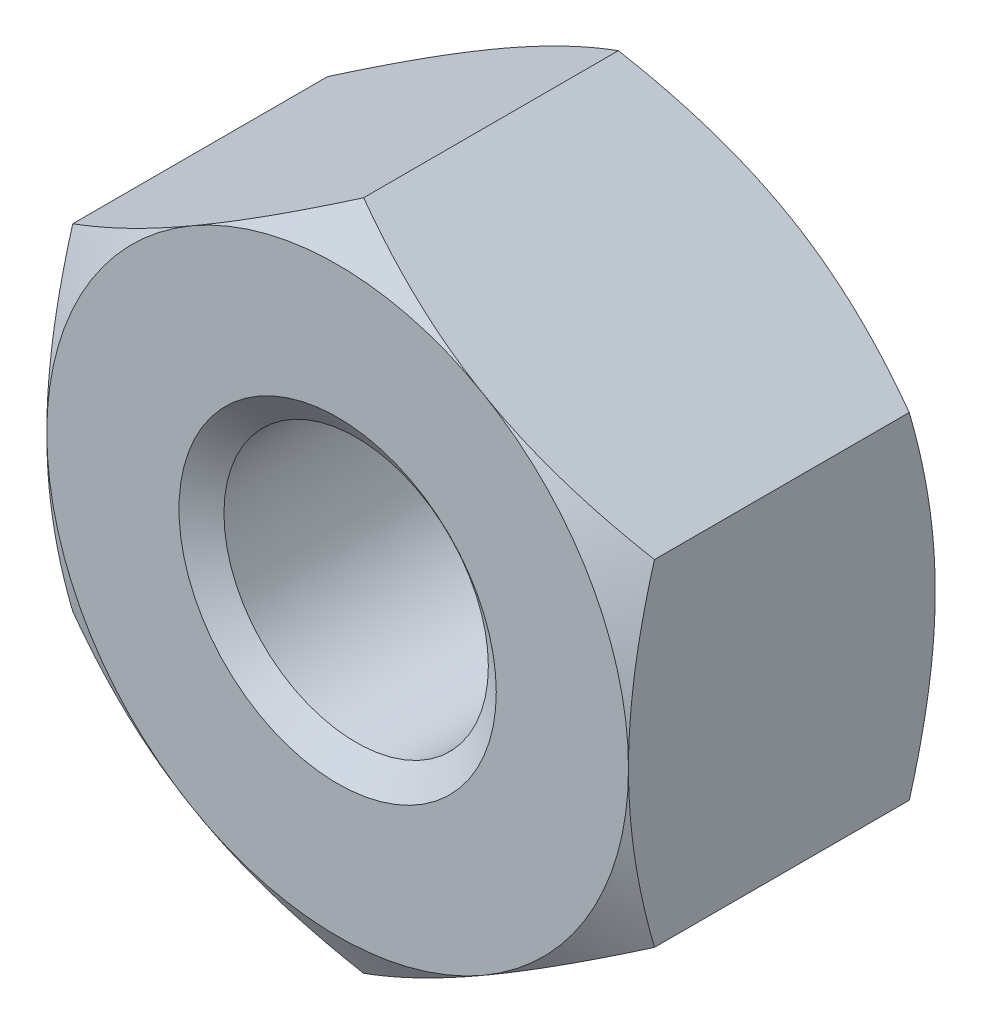
ISO-10303-21;
HEADER;
FILE_DESCRIPTION(('STEP AP214'),'2;1');
FILE_NAME('part.step','',(''),(''),'','','');
FILE_SCHEMA(('AUTOMOTIVE_DESIGN { 1 0 10303 214 1 1 1 1 }'));
ENDSEC;
DATA;
#1=APPLICATION_CONTEXT('core data for automotive mechanical design processes');
#2=APPLICATION_PROTOCOL_DEFINITION('international standard','automotive_design',2000,#1);
#3=PRODUCT_CONTEXT('',#1,'mechanical');
#4=PRODUCT('Part','Part','',(#3));
#5=PRODUCT_RELATED_PRODUCT_CATEGORY('part','',(#4));
#6=PRODUCT_DEFINITION_FORMATION('','',#4);
#7=PRODUCT_DEFINITION_CONTEXT('part definition',#1,'design');
#8=PRODUCT_DEFINITION('design','',#6,#7);
#9=PRODUCT_DEFINITION_SHAPE('','',#8);
#10=(LENGTH_UNIT() NAMED_UNIT(*) SI_UNIT(.MILLI.,.METRE.));
#11=(NAMED_UNIT(*) PLANE_ANGLE_UNIT() SI_UNIT($,.RADIAN.));
#12=(NAMED_UNIT(*) SI_UNIT($,.STERADIAN.) SOLID_ANGLE_UNIT());
#13=UNCERTAINTY_MEASURE_WITH_UNIT(LENGTH_MEASURE(1.E-05),#10,'distance_accuracy_value','');
#14=(GEOMETRIC_REPRESENTATION_CONTEXT(3) GLOBAL_UNCERTAINTY_ASSIGNED_CONTEXT((#13)) GLOBAL_UNIT_ASSIGNED_CONTEXT((#10,
#11,#12)) REPRESENTATION_CONTEXT('',''));
#15=CARTESIAN_POINT('',(0.,0.,0.));
#16=DIRECTION('',(0.,0.,1.));
#17=DIRECTION('',(1.,0.,0.));
#18=AXIS2_PLACEMENT_3D('',#15,#16,#17);
#19=CARTESIAN_POINT('',(0.,0.,-2.9));
#20=DIRECTION('',(0.,0.,1.));
#21=DIRECTION('',(1.,0.,0.));
#22=AXIS2_PLACEMENT_3D('',#19,#20,#21);
#23=CYLINDRICAL_SURFACE('',#22,1.25);
#24=CARTESIAN_POINT('',(0.,0.,-0.175051884552432));
#25=DIRECTION('',(0.,0.,1.));
#26=DIRECTION('',(1.,0.,0.));
#27=AXIS2_PLACEMENT_3D('',#24,#25,#26);
#28=CIRCLE('',#27,1.25);
#29=CARTESIAN_POINT('',(1.25,0.,-0.175051884552432));
#30=VERTEX_POINT('',#29);
#31=EDGE_CURVE('E174',#30,#30,#28,.F.);
#32=ORIENTED_EDGE('',*,*,#31,.F.);
#33=EDGE_LOOP('',(#32));
#34=FACE_BOUND('',#33,.T.);
#35=CARTESIAN_POINT('',(0.,0.,-2.69954811544757));
#36=DIRECTION('',(0.,0.,-1.));
#37=DIRECTION('',(-1.,0.,0.));
#38=AXIS2_PLACEMENT_3D('',#35,#36,#37);
#39=CIRCLE('',#38,1.25);
#40=CARTESIAN_POINT('',(-1.25,0.,-2.69954811544757));
#41=VERTEX_POINT('',#40);
#42=EDGE_CURVE('E39',#41,#41,#39,.F.);
#43=ORIENTED_EDGE('',*,*,#42,.F.);
#44=EDGE_LOOP('',(#43));
#45=FACE_BOUND('',#44,.T.);
#46=ADVANCED_FACE('F34',(#34,#45),#23,.F.);
#47=CARTESIAN_POINT('',(0.,3.17542648054296,-2.9));
#48=DIRECTION('',(0.,0.,-1.));
#49=DIRECTION('',(-1.,0.,0.));
#50=AXIS2_PLACEMENT_3D('',#47,#48,#49);
#51=PLANE('',#50);
#52=CARTESIAN_POINT('',(0.,0.,-2.9));
#53=DIRECTION('',(0.,0.,-1.));
#54=DIRECTION('',(-1.,0.,0.));
#55=AXIS2_PLACEMENT_3D('',#52,#53,#54);
#56=CIRCLE('',#55,2.75);
#57=CARTESIAN_POINT('',(-2.75,0.,-2.9));
#58=VERTEX_POINT('',#57);
#59=CARTESIAN_POINT('',(-1.37500000000002,-2.3815698604072,-2.9));
#60=VERTEX_POINT('',#59);
#61=EDGE_CURVE('E170',#58,#60,#56,.F.);
#62=ORIENTED_EDGE('',*,*,#61,.F.);
#63=CARTESIAN_POINT('',(-1.37500000000002,2.38156986040719,-2.9));
#64=VERTEX_POINT('',#63);
#65=EDGE_CURVE('E152',#64,#58,#56,.F.);
#66=ORIENTED_EDGE('',*,*,#65,.F.);
#67=CARTESIAN_POINT('',(1.37500000000002,2.38156986040719,-2.9));
#68=VERTEX_POINT('',#67);
#69=EDGE_CURVE('E169',#68,#64,#56,.F.);
#70=ORIENTED_EDGE('',*,*,#69,.F.);
#71=CARTESIAN_POINT('',(0.,0.,-2.9));
#72=DIRECTION('',(0.,0.,1.));
#73=DIRECTION('',(1.,0.,0.));
#74=AXIS2_PLACEMENT_3D('',#71,#72,#73);
#75=CIRCLE('',#74,2.75);
#76=CARTESIAN_POINT('',(2.75,0.,-2.9));
#77=VERTEX_POINT('',#76);
#78=EDGE_CURVE('E244',#77,#68,#75,.T.);
#79=ORIENTED_EDGE('',*,*,#78,.F.);
#80=CARTESIAN_POINT('',(1.37500000000002,-2.38156986040719,-2.9));
#81=VERTEX_POINT('',#80);
#82=EDGE_CURVE('E360',#81,#77,#56,.F.);
#83=ORIENTED_EDGE('',*,*,#82,.F.);
#84=EDGE_CURVE('E364',#60,#81,#56,.F.);
#85=ORIENTED_EDGE('',*,*,#84,.F.);
#86=EDGE_LOOP('',(#62,#66,#70,#79,#83,#85));
#87=FACE_BOUND('',#86,.T.);
#88=CARTESIAN_POINT('',(0.,0.,-2.9));
#89=DIRECTION('',(0.,0.,-1.));
#90=DIRECTION('',(-1.,0.,0.));
#91=AXIS2_PLACEMENT_3D('',#88,#89,#90);
#92=CIRCLE('',#91,1.5);
#93=CARTESIAN_POINT('',(-1.5,0.,-2.9));
#94=VERTEX_POINT('',#93);
#95=EDGE_CURVE('E177',#94,#94,#92,.F.);
#96=ORIENTED_EDGE('',*,*,#95,.T.);
#97=EDGE_LOOP('',(#96));
#98=FACE_BOUND('',#97,.T.);
#99=ADVANCED_FACE('F297',(#87,#98),#51,.T.);
#100=CARTESIAN_POINT('',(0.,3.17542648054296,0.));
#101=DIRECTION('',(0.,0.,-1.));
#102=DIRECTION('',(-1.,0.,0.));
#103=AXIS2_PLACEMENT_3D('',#100,#101,#102);
#104=PLANE('',#103);
#105=CARTESIAN_POINT('',(0.,0.,0.));
#106=DIRECTION('',(0.,0.,-1.));
#107=DIRECTION('',(-1.,0.,0.));
#108=AXIS2_PLACEMENT_3D('',#105,#106,#107);
#109=CIRCLE('',#108,2.75);
#110=CARTESIAN_POINT('',(-2.75,0.,0.));
#111=VERTEX_POINT('',#110);
#112=CARTESIAN_POINT('',(-1.37500000000002,2.38156986040719,0.));
#113=VERTEX_POINT('',#112);
#114=EDGE_CURVE('E11',#111,#113,#109,.T.);
#115=ORIENTED_EDGE('',*,*,#114,.F.);
#116=CARTESIAN_POINT('',(-1.37500000000002,-2.3815698604072,0.));
#117=VERTEX_POINT('',#116);
#118=EDGE_CURVE('E46',#117,#111,#109,.T.);
#119=ORIENTED_EDGE('',*,*,#118,.F.);
#120=CARTESIAN_POINT('',(1.37500000000002,-2.38156986040719,0.));
#121=VERTEX_POINT('',#120);
#122=EDGE_CURVE('E173',#121,#117,#109,.T.);
#123=ORIENTED_EDGE('',*,*,#122,.F.);
#124=CARTESIAN_POINT('',(2.75,0.,0.));
#125=VERTEX_POINT('',#124);
#126=EDGE_CURVE('E351',#125,#121,#109,.T.);
#127=ORIENTED_EDGE('',*,*,#126,.F.);
#128=CARTESIAN_POINT('',(0.,0.,0.));
#129=DIRECTION('',(0.,0.,1.));
#130=DIRECTION('',(1.,0.,0.));
#131=AXIS2_PLACEMENT_3D('',#128,#129,#130);
#132=CIRCLE('',#131,2.75);
#133=CARTESIAN_POINT('',(1.37500000000002,2.38156986040719,0.));
#134=VERTEX_POINT('',#133);
#135=EDGE_CURVE('E128',#125,#134,#132,.T.);
#136=ORIENTED_EDGE('',*,*,#135,.T.);
#137=EDGE_CURVE('E44',#113,#134,#109,.T.);
#138=ORIENTED_EDGE('',*,*,#137,.F.);
#139=EDGE_LOOP('',(#115,#119,#123,#127,#136,#138));
#140=FACE_BOUND('',#139,.T.);
#141=CARTESIAN_POINT('',(0.,0.,0.));
#142=DIRECTION('',(0.,0.,1.));
#143=DIRECTION('',(1.,0.,0.));
#144=AXIS2_PLACEMENT_3D('',#141,#142,#143);
#145=CIRCLE('',#144,1.5);
#146=CARTESIAN_POINT('',(1.5,0.,0.));
#147=VERTEX_POINT('',#146);
#148=EDGE_CURVE('E176',#147,#147,#145,.T.);
#149=ORIENTED_EDGE('',*,*,#148,.F.);
#150=EDGE_LOOP('',(#149));
#151=FACE_BOUND('',#150,.T.);
#152=ADVANCED_FACE('F249',(#140,#151),#104,.F.);
#153=CARTESIAN_POINT('',(0.,3.17542648054296,-2.9));
#154=DIRECTION('',(-0.500000000000008,0.866025403784434,0.));
#155=DIRECTION('',(-0.866025403784434,-0.500000000000008,0.));
#156=AXIS2_PLACEMENT_3D('',#153,#154,#155);
#157=PLANE('',#156);
#158=DIRECTION('',(0.,0.,1.));
#159=VECTOR('',#158,1.);
#160=CARTESIAN_POINT('',(-2.75,1.58771324027145,-2.9));
#161=LINE('',#160,#159);
#162=CARTESIAN_POINT('',(-2.75,1.58771324027151,-2.65437990693812));
#163=VERTEX_POINT('',#162);
#164=CARTESIAN_POINT('',(-2.75,1.58771324027145,-0.24562009306186));
#165=VERTEX_POINT('',#164);
#166=EDGE_CURVE('E164',#163,#165,#161,.T.);
#167=ORIENTED_EDGE('',*,*,#166,.T.);
#168=CARTESIAN_POINT('',(-2.7502,1.58759777021761,-0.245686763364759));
#169=CARTESIAN_POINT('',(-2.62935077934009,1.65737010029697,-0.205387662249261));
#170=CARTESIAN_POINT('',(-2.50745839737737,1.72774469983531,-0.16873690259766));
#171=CARTESIAN_POINT('',(-2.26156287327211,1.86971254687001,-0.104762182969798));
#172=CARTESIAN_POINT('',(-2.13755536142615,1.94130831721582,-0.0774608556744948));
#173=CARTESIAN_POINT('',(-1.89107720202406,2.08361254889598,-0.0349617452941144));
#174=CARTESIAN_POINT('',(-1.76864448141259,2.15429911309863,-0.0194811186224555));
#175=CARTESIAN_POINT('',(-1.52320285763109,2.29600490065922,-0.000999397369938858));
#176=CARTESIAN_POINT('',(-1.4001948467671,2.36702360884403,0.00201700053740133));
#177=CARTESIAN_POINT('',(-1.17034121338921,2.49972966594897,-0.00425314542854674));
#178=CARTESIAN_POINT('',(-1.06346120874598,2.56143686540072,-0.0120001542767031));
#179=CARTESIAN_POINT('',(-0.850397532665255,2.68444923614047,-0.0365551810643573));
#180=CARTESIAN_POINT('',(-0.744214598351115,2.74575398185008,-0.0533715896505739));
#181=CARTESIAN_POINT('',(-0.530711510606819,2.86902004703207,-0.0954119223459625));
#182=CARTESIAN_POINT('',(-0.423418383857147,2.93096576264319,-0.120814080687238));
#183=CARTESIAN_POINT('',(-0.210432520715949,3.05393320806135,-0.178467225839992));
#184=CARTESIAN_POINT('',(-0.104737054973347,3.11495651365997,-0.210704663298995));
#185=CARTESIAN_POINT('',(0.000200000000001484,3.1755419505968,-0.245686763364774));
#186=B_SPLINE_CURVE_WITH_KNOTS('',3,(#168,#169,#170,#171,#172,#173,#174,#175,#176,#177,#178,
#179,#180,#181,#182,#183,#184,#185),.UNSPECIFIED.,.F.,.F.,(4,2,2,2,2,2,2,2,4),(0.,
0.435912828725888,0.872873557116333,1.29901931904672,1.72464171213574,2.09526089052938,
2.46622354066375,2.84541551798559,3.22386274754526),.UNSPECIFIED.);
#187=EDGE_CURVE('E133',#165,#113,#186,.T.);
#188=ORIENTED_EDGE('',*,*,#187,.T.);
#189=CARTESIAN_POINT('',(0.,3.17542648054296,-0.245620093061876));
#190=VERTEX_POINT('',#189);
#191=EDGE_CURVE('E53',#113,#190,#186,.T.);
#192=ORIENTED_EDGE('',*,*,#191,.T.);
#193=DIRECTION('',(0.,0.,1.));
#194=VECTOR('',#193,1.);
#195=CARTESIAN_POINT('',(0.,3.17542648054296,-2.9));
#196=LINE('',#195,#194);
#197=CARTESIAN_POINT('',(0.,3.17542648054296,-2.65437990693812));
#198=VERTEX_POINT('',#197);
#199=EDGE_CURVE('E149',#198,#190,#196,.T.);
#200=ORIENTED_EDGE('',*,*,#199,.F.);
#201=CARTESIAN_POINT('',(-2.7502,1.58759777021761,-2.65431323663524));
#202=CARTESIAN_POINT('',(-2.62935077934009,1.65737010029697,-2.69461233775074));
#203=CARTESIAN_POINT('',(-2.50745839737737,1.72774469983531,-2.73126309740234));
#204=CARTESIAN_POINT('',(-2.26156287327211,1.86971254687001,-2.7952378170302));
#205=CARTESIAN_POINT('',(-2.13755536142615,1.94130831721582,-2.8225391443255));
#206=CARTESIAN_POINT('',(-1.89107720202406,2.08361254889598,-2.86503825470589));
#207=CARTESIAN_POINT('',(-1.76864448141259,2.15429911309863,-2.88051888137754));
#208=CARTESIAN_POINT('',(-1.52320285763109,2.29600490065922,-2.89900060263006));
#209=CARTESIAN_POINT('',(-1.4001948467671,2.36702360884403,-2.9020170005374));
#210=CARTESIAN_POINT('',(-1.17034121338921,2.49972966594897,-2.89574685457145));
#211=CARTESIAN_POINT('',(-1.06346120874598,2.56143686540072,-2.8879998457233));
#212=CARTESIAN_POINT('',(-0.850397532665255,2.68444923614047,-2.86344481893564));
#213=CARTESIAN_POINT('',(-0.744214598351115,2.74575398185008,-2.84662841034943));
#214=CARTESIAN_POINT('',(-0.530711510606819,2.86902004703207,-2.80458807765404));
#215=CARTESIAN_POINT('',(-0.423418383857147,2.93096576264319,-2.77918591931276));
#216=CARTESIAN_POINT('',(-0.210432520715949,3.05393320806135,-2.72153277416001));
#217=CARTESIAN_POINT('',(-0.104737054973347,3.11495651365997,-2.68929533670101));
#218=CARTESIAN_POINT('',(0.000200000000001484,3.1755419505968,-2.65431323663523));
#219=B_SPLINE_CURVE_WITH_KNOTS('',3,(#201,#202,#203,#204,#205,#206,#207,#208,#209,#210,#211,
#212,#213,#214,#215,#216,#217,#218),.UNSPECIFIED.,.F.,.F.,(4,2,2,2,2,2,2,2,4),(0.,
0.435912828725888,0.872873557116333,1.29901931904672,1.72464171213574,2.09526089052938,
2.46622354066375,2.84541551798559,3.22386274754526),.UNSPECIFIED.);
#220=EDGE_CURVE('E167',#64,#198,#219,.T.);
#221=ORIENTED_EDGE('',*,*,#220,.F.);
#222=EDGE_CURVE('E259',#163,#64,#219,.T.);
#223=ORIENTED_EDGE('',*,*,#222,.F.);
#224=EDGE_LOOP('',(#167,#188,#192,#200,#221,#223));
#225=FACE_BOUND('',#224,.T.);
#226=ADVANCED_FACE('F36',(#225),#157,.T.);
#227=CARTESIAN_POINT('',(2.75,1.58771324027146,-2.9));
#228=DIRECTION('',(0.500000000000008,0.866025403784434,0.));
#229=DIRECTION('',(-0.866025403784434,0.500000000000008,0.));
#230=AXIS2_PLACEMENT_3D('',#227,#228,#229);
#231=PLANE('',#230);
#232=ORIENTED_EDGE('',*,*,#199,.T.);
#233=CARTESIAN_POINT('',(-0.00019999999999841,3.1755419505968,-0.245686763364774));
#234=CARTESIAN_POINT('',(0.120649220659907,3.10576962051744,-0.205387662249276));
#235=CARTESIAN_POINT('',(0.242541602622635,3.03539502097909,-0.168736902597673));
#236=CARTESIAN_POINT('',(0.488437126727895,2.8934271739444,-0.104762182969809));
#237=CARTESIAN_POINT('',(0.612444638573858,2.82183140359859,-0.0774608556745041));
#238=CARTESIAN_POINT('',(0.858922797975947,2.67952717191843,-0.0349617452941211));
#239=CARTESIAN_POINT('',(0.98135551858742,2.60884060771578,-0.0194811186224611));
#240=CARTESIAN_POINT('',(1.22679714236892,2.46713482015519,-0.000999397369942027));
#241=CARTESIAN_POINT('',(1.34980515323292,2.39611611197038,0.0020170005373994));
#242=CARTESIAN_POINT('',(1.5796587866108,2.26341005486544,-0.00425314542854663));
#243=CARTESIAN_POINT('',(1.68653879125402,2.20170285541368,-0.0120001542767019));
#244=CARTESIAN_POINT('',(1.89960246733475,2.07869048467394,-0.0365551810643538));
#245=CARTESIAN_POINT('',(2.00578540164889,2.01738573896433,-0.0533715896505692));
#246=CARTESIAN_POINT('',(2.21928848939318,1.89411967378234,-0.0954119223459551));
#247=CARTESIAN_POINT('',(2.32658161614286,1.83217395817122,-0.12081408068723));
#248=CARTESIAN_POINT('',(2.53956747928405,1.70920651275306,-0.178467225839981));
#249=CARTESIAN_POINT('',(2.64526294502665,1.64818320715445,-0.210704663298982));
#250=CARTESIAN_POINT('',(2.7502,1.58759777021762,-0.24568676336476));
#251=B_SPLINE_CURVE_WITH_KNOTS('',3,(#233,#234,#235,#236,#237,#238,#239,#240,#241,#242,#243,
#244,#245,#246,#247,#248,#249,#250),.UNSPECIFIED.,.F.,.F.,(4,2,2,2,2,2,2,2,4),(0.,
0.435912828725892,0.872873557116339,1.29901931904673,1.72464171213575,2.09526089052939,
2.46622354066376,2.84541551798559,3.22386274754526),.UNSPECIFIED.);
#252=EDGE_CURVE('E143',#190,#134,#251,.T.);
#253=ORIENTED_EDGE('',*,*,#252,.T.);
#254=CARTESIAN_POINT('',(2.75,1.58771324027151,-0.245620093061876));
#255=VERTEX_POINT('',#254);
#256=EDGE_CURVE('E60',#134,#255,#251,.T.);
#257=ORIENTED_EDGE('',*,*,#256,.T.);
#258=DIRECTION('',(0.,0.,1.));
#259=VECTOR('',#258,1.);
#260=CARTESIAN_POINT('',(2.75,1.58771324027146,-2.9));
#261=LINE('',#260,#259);
#262=CARTESIAN_POINT('',(2.75,1.58771324027151,-2.65437990693812));
#263=VERTEX_POINT('',#262);
#264=EDGE_CURVE('E142',#263,#255,#261,.T.);
#265=ORIENTED_EDGE('',*,*,#264,.F.);
#266=CARTESIAN_POINT('',(-0.00019999999999841,3.1755419505968,-2.65431323663523));
#267=CARTESIAN_POINT('',(0.120649220659908,3.10576962051744,-2.69461233775072));
#268=CARTESIAN_POINT('',(0.242541602622636,3.03539502097909,-2.73126309740233));
#269=CARTESIAN_POINT('',(0.488437126727895,2.8934271739444,-2.79523781703019));
#270=CARTESIAN_POINT('',(0.612444638573858,2.82183140359859,-2.8225391443255));
#271=CARTESIAN_POINT('',(0.858922797975947,2.67952717191843,-2.86503825470588));
#272=CARTESIAN_POINT('',(0.98135551858742,2.60884060771578,-2.88051888137754));
#273=CARTESIAN_POINT('',(1.22679714236892,2.46713482015519,-2.89900060263006));
#274=CARTESIAN_POINT('',(1.34980515323292,2.39611611197038,-2.9020170005374));
#275=CARTESIAN_POINT('',(1.5796587866108,2.26341005486544,-2.89574685457145));
#276=CARTESIAN_POINT('',(1.68653879125402,2.20170285541368,-2.8879998457233));
#277=CARTESIAN_POINT('',(1.89960246733475,2.07869048467394,-2.86344481893565));
#278=CARTESIAN_POINT('',(2.00578540164889,2.01738573896433,-2.84662841034943));
#279=CARTESIAN_POINT('',(2.21928848939318,1.89411967378234,-2.80458807765404));
#280=CARTESIAN_POINT('',(2.32658161614286,1.83217395817122,-2.77918591931277));
#281=CARTESIAN_POINT('',(2.53956747928405,1.70920651275306,-2.72153277416002));
#282=CARTESIAN_POINT('',(2.64526294502665,1.64818320715445,-2.68929533670102));
#283=CARTESIAN_POINT('',(2.7502,1.58759777021762,-2.65431323663524));
#284=B_SPLINE_CURVE_WITH_KNOTS('',3,(#266,#267,#268,#269,#270,#271,#272,#273,#274,#275,#276,
#277,#278,#279,#280,#281,#282,#283),.UNSPECIFIED.,.F.,.F.,(4,2,2,2,2,2,2,2,4),(0.,
0.435912828725892,0.87287355711634,1.29901931904673,1.72464171213575,2.09526089052939,
2.46622354066376,2.84541551798559,3.22386274754526),.UNSPECIFIED.);
#285=EDGE_CURVE('E253',#68,#263,#284,.T.);
#286=ORIENTED_EDGE('',*,*,#285,.F.);
#287=EDGE_CURVE('E258',#198,#68,#284,.T.);
#288=ORIENTED_EDGE('',*,*,#287,.F.);
#289=EDGE_LOOP('',(#232,#253,#257,#265,#286,#288));
#290=FACE_BOUND('',#289,.T.);
#291=ADVANCED_FACE('F140',(#290),#231,.T.);
#292=CARTESIAN_POINT('',(2.75,1.58771324027146,-2.9));
#293=DIRECTION('',(-1.,0.,0.));
#294=DIRECTION('',(0.,0.,1.));
#295=AXIS2_PLACEMENT_3D('',#292,#293,#294);
#296=PLANE('',#295);
#297=CARTESIAN_POINT('',(2.75,-4.21084949309679,-1.31594843960297));
#298=CARTESIAN_POINT('',(2.75,-4.09010894214093,-1.25759993615227));
#299=CARTESIAN_POINT('',(2.75,-3.96908292065512,-1.19983146511761));
#300=CARTESIAN_POINT('',(2.75,-3.72630558284847,-1.08578603842308));
#301=CARTESIAN_POINT('',(2.75,-3.60455414536203,-1.0295093410025));
#302=CARTESIAN_POINT('',(2.75,-3.35951393034357,-0.918482443352782));
#303=CARTESIAN_POINT('',(2.75,-3.23622034236439,-0.863742821605862));
#304=CARTESIAN_POINT('',(2.75,-2.98861980138746,-0.756614777476476));
#305=CARTESIAN_POINT('',(2.75,-2.86431290161185,-0.704226232536785));
#306=CARTESIAN_POINT('',(2.75,-2.61294485887175,-0.601803572146143));
#307=CARTESIAN_POINT('',(2.75,-2.48586863815657,-0.551806257898411));
#308=CARTESIAN_POINT('',(2.75,-2.23021732171543,-0.455727408784617));
#309=CARTESIAN_POINT('',(2.75,-2.10164206103366,-0.409646309576986));
#310=CARTESIAN_POINT('',(2.75,-1.8430521879947,-0.322638077046243));
#311=CARTESIAN_POINT('',(2.75,-1.71304130052586,-0.281699986413899));
#312=CARTESIAN_POINT('',(2.75,-1.4511712506215,-0.206307307624357));
#313=CARTESIAN_POINT('',(2.75,-1.31931268690205,-0.171850669152775));
#314=CARTESIAN_POINT('',(2.75,-1.05365722480015,-0.11109367153091));
#315=CARTESIAN_POINT('',(2.75,-0.919859820217613,-0.0847954840951266));
#316=CARTESIAN_POINT('',(2.75,-0.650651874037402,-0.0421260371966145));
#317=CARTESIAN_POINT('',(2.75,-0.515241331013615,-0.0257547865105455));
#318=CARTESIAN_POINT('',(2.75,-0.24437324286923,-0.00438749654023847));
#319=CARTESIAN_POINT('',(2.75,-0.108921526377152,0.00068055677321543));
#320=CARTESIAN_POINT('',(2.75,0.161887058855117,-0.000827795632671484));
#321=CARTESIAN_POINT('',(2.75,0.297243943089624,-0.00740117868555267));
#322=CARTESIAN_POINT('',(2.75,0.528385436717524,-0.0281041300468421));
#323=CARTESIAN_POINT('',(2.75,0.62442505013748,-0.039537641030186));
#324=CARTESIAN_POINT('',(2.75,0.815762399811519,-0.0675217196133478));
#325=CARTESIAN_POINT('',(2.75,0.911060016631939,-0.0840730942276785));
#326=CARTESIAN_POINT('',(2.75,1.19576218748913,-0.140535361278279));
#327=CARTESIAN_POINT('',(2.75,1.38383224738493,-0.187239859417287));
#328=CARTESIAN_POINT('',(2.75,1.66525048947481,-0.267792497030569));
#329=CARTESIAN_POINT('',(2.75,1.76006556248553,-0.296803334995491));
#330=CARTESIAN_POINT('',(2.75,1.9487060938221,-0.357695648906576));
#331=CARTESIAN_POINT('',(2.75,2.04253218553691,-0.389575144878491));
#332=CARTESIAN_POINT('',(2.75,2.22880240354979,-0.455541418186434));
#333=CARTESIAN_POINT('',(2.75,2.32125133588446,-0.489614761455518));
#334=CARTESIAN_POINT('',(2.75,2.50543192042622,-0.559761368231093));
#335=CARTESIAN_POINT('',(2.75,2.59716326539573,-0.5958354400373));
#336=CARTESIAN_POINT('',(2.75,2.68856293053339,-0.632712441997466));
#337=B_SPLINE_CURVE_WITH_KNOTS('',3,(#297,#298,#299,#300,#301,#302,#303,#304,#305,#306,#307,
#308,#309,#310,#311,#312,#313,#314,#315,#316,#317,#318,#319,#320,#321,#322,#323,#324,#325,#326,
#327,#328,#329,#330,#331,#332,#333,#334,#335,#336),.UNSPECIFIED.,.F.,.F.,(4,2,2,2,2,2,2,2,2,2,2,
2,2,2,2,2,2,2,2,4),(0.,0.402305607365937,0.804680408536999,1.20935783819118,1.61401414820819,
2.02363838185771,2.4333081245735,2.84208969479601,3.25074173456638,3.65950246109145,
4.06826354901185,4.47441284024652,4.88045669141174,5.17046846817547,5.46052599902453,
6.04107275309882,6.3385113130466,6.63574613017453,6.9313079100579,7.22698998004819),.UNSPECIFIED.);
#338=CARTESIAN_POINT('',(2.75000000000001,-1.58771324027149,-0.245620093061876));
#339=VERTEX_POINT('',#338);
#340=EDGE_CURVE('E135',#339,#125,#337,.T.);
#341=ORIENTED_EDGE('',*,*,#340,.F.);
#342=DIRECTION('',(0.,0.,1.));
#343=VECTOR('',#342,1.);
#344=CARTESIAN_POINT('',(2.75,-1.5877132402715,-2.9));
#345=LINE('',#344,#343);
#346=CARTESIAN_POINT('',(2.75000000000001,-1.58771324027149,-2.65437990693812));
#347=VERTEX_POINT('',#346);
#348=EDGE_CURVE('E150',#347,#339,#345,.T.);
#349=ORIENTED_EDGE('',*,*,#348,.F.);
#350=CARTESIAN_POINT('',(2.75,-4.21084949309679,-1.58405156039703));
#351=CARTESIAN_POINT('',(2.75,-4.09010894214093,-1.64240006384773));
#352=CARTESIAN_POINT('',(2.75,-3.96908292065512,-1.70016853488238));
#353=CARTESIAN_POINT('',(2.75,-3.72630558284847,-1.81421396157692));
#354=CARTESIAN_POINT('',(2.75,-3.60455414536203,-1.8704906589975));
#355=CARTESIAN_POINT('',(2.75,-3.35951393034357,-1.98151755664722));
#356=CARTESIAN_POINT('',(2.75,-3.23622034236439,-2.03625717839414));
#357=CARTESIAN_POINT('',(2.75,-2.98861980138746,-2.14338522252352));
#358=CARTESIAN_POINT('',(2.75,-2.86431290161185,-2.19577376746322));
#359=CARTESIAN_POINT('',(2.75,-2.61294485887175,-2.29819642785386));
#360=CARTESIAN_POINT('',(2.75,-2.48586863815657,-2.34819374210159));
#361=CARTESIAN_POINT('',(2.75,-2.23021732171543,-2.44427259121538));
#362=CARTESIAN_POINT('',(2.75,-2.10164206103366,-2.49035369042301));
#363=CARTESIAN_POINT('',(2.75,-1.8430521879947,-2.57736192295376));
#364=CARTESIAN_POINT('',(2.75,-1.71304130052586,-2.6183000135861));
#365=CARTESIAN_POINT('',(2.75,-1.4511712506215,-2.69369269237564));
#366=CARTESIAN_POINT('',(2.75,-1.31931268690205,-2.72814933084722));
#367=CARTESIAN_POINT('',(2.75,-1.05365722480015,-2.78890632846909));
#368=CARTESIAN_POINT('',(2.75,-0.919859820217613,-2.81520451590487));
#369=CARTESIAN_POINT('',(2.75,-0.650651874037402,-2.85787396280339));
#370=CARTESIAN_POINT('',(2.75,-0.515241331013615,-2.87424521348945));
#371=CARTESIAN_POINT('',(2.75,-0.24437324286923,-2.89561250345976));
#372=CARTESIAN_POINT('',(2.75,-0.108921526377152,-2.90068055677322));
#373=CARTESIAN_POINT('',(2.75,0.161887058855117,-2.89917220436733));
#374=CARTESIAN_POINT('',(2.75,0.297243943089624,-2.89259882131445));
#375=CARTESIAN_POINT('',(2.75,0.528385436717524,-2.87189586995316));
#376=CARTESIAN_POINT('',(2.75,0.624425050137481,-2.86046235896981));
#377=CARTESIAN_POINT('',(2.75,0.815762399811519,-2.83247828038665));
#378=CARTESIAN_POINT('',(2.75,0.91106001663194,-2.81592690577232));
#379=CARTESIAN_POINT('',(2.75,1.19576218748913,-2.75946463872172));
#380=CARTESIAN_POINT('',(2.75,1.38383224738493,-2.71276014058271));
#381=CARTESIAN_POINT('',(2.75,1.66525048947481,-2.63220750296943));
#382=CARTESIAN_POINT('',(2.75,1.76006556248553,-2.60319666500451));
#383=CARTESIAN_POINT('',(2.75,1.9487060938221,-2.54230435109342));
#384=CARTESIAN_POINT('',(2.75,2.04253218553691,-2.51042485512151));
#385=CARTESIAN_POINT('',(2.75,2.22880240354979,-2.44445858181357));
#386=CARTESIAN_POINT('',(2.75,2.32125133588446,-2.41038523854448));
#387=CARTESIAN_POINT('',(2.75,2.50543192042623,-2.34023863176891));
#388=CARTESIAN_POINT('',(2.75,2.59716326539573,-2.3041645599627));
#389=CARTESIAN_POINT('',(2.75,2.68856293053339,-2.26728755800253));
#390=B_SPLINE_CURVE_WITH_KNOTS('',3,(#350,#351,#352,#353,#354,#355,#356,#357,#358,#359,#360,
#361,#362,#363,#364,#365,#366,#367,#368,#369,#370,#371,#372,#373,#374,#375,#376,#377,#378,#379,
#380,#381,#382,#383,#384,#385,#386,#387,#388,#389),.UNSPECIFIED.,.F.,.F.,(4,2,2,2,2,2,2,2,2,2,2,
2,2,2,2,2,2,2,2,4),(0.,0.402305607365937,0.804680408536999,1.20935783819118,1.61401414820819,
2.02363838185771,2.4333081245735,2.84208969479601,3.25074173456638,3.65950246109145,
4.06826354901185,4.47441284024652,4.88045669141174,5.17046846817547,5.46052599902453,
6.04107275309882,6.3385113130466,6.63574613017453,6.9313079100579,7.2269899800482),.UNSPECIFIED.);
#391=EDGE_CURVE('E265',#347,#77,#390,.T.);
#392=ORIENTED_EDGE('',*,*,#391,.T.);
#393=EDGE_CURVE('E148',#77,#263,#390,.T.);
#394=ORIENTED_EDGE('',*,*,#393,.T.);
#395=ORIENTED_EDGE('',*,*,#264,.T.);
#396=EDGE_CURVE('E125',#125,#255,#337,.T.);
#397=ORIENTED_EDGE('',*,*,#396,.F.);
#398=EDGE_LOOP('',(#341,#349,#392,#394,#395,#397));
#399=FACE_BOUND('',#398,.T.);
#400=ADVANCED_FACE('F146',(#399),#296,.F.);
#401=CARTESIAN_POINT('',(0.,-3.175426480543,-2.9));
#402=DIRECTION('',(0.500000000000007,-0.866025403784435,0.));
#403=DIRECTION('',(0.866025403784435,0.500000000000007,0.));
#404=AXIS2_PLACEMENT_3D('',#401,#402,#403);
#405=PLANE('',#404);
#406=ORIENTED_EDGE('',*,*,#348,.T.);
#407=CARTESIAN_POINT('',(2.7502,-1.58759777021766,-0.245686763364772));
#408=CARTESIAN_POINT('',(2.62935077934009,-1.65737010029702,-0.205387662249275));
#409=CARTESIAN_POINT('',(2.50745839737736,-1.72774469983536,-0.168736902597674));
#410=CARTESIAN_POINT('',(2.2615628732721,-1.86971254687006,-0.104762182969814));
#411=CARTESIAN_POINT('',(2.13755536142614,-1.94130831721586,-0.0774608556745108));
#412=CARTESIAN_POINT('',(1.89107720202405,-2.08361254889603,-0.034961745294132));
#413=CARTESIAN_POINT('',(1.76864448141258,-2.15429911309868,-0.0194811186224742));
#414=CARTESIAN_POINT('',(1.52320285763108,-2.29600490065927,-0.000999397369959439));
#415=CARTESIAN_POINT('',(1.40019484676708,-2.36702360884408,0.00201700053737997));
#416=CARTESIAN_POINT('',(1.1703412133892,-2.49972966594902,-0.00425314542856976));
#417=CARTESIAN_POINT('',(1.06346120874597,-2.56143686540077,-0.0120001542767267));
#418=CARTESIAN_POINT('',(0.850397532665246,-2.68444923614051,-0.0365551810643817));
#419=CARTESIAN_POINT('',(0.744214598351107,-2.74575398185013,-0.0533715896505985));
#420=CARTESIAN_POINT('',(0.530711510606813,-2.86902004703211,-0.095411922345987));
#421=CARTESIAN_POINT('',(0.423418383857143,-2.93096576264323,-0.120814080687263));
#422=CARTESIAN_POINT('',(0.210432520715948,-3.05393320806139,-0.178467225840016));
#423=CARTESIAN_POINT('',(0.104737054973347,-3.11495651366001,-0.210704663299018));
#424=CARTESIAN_POINT('',(-0.000199999999999593,-3.17554195059683,-0.245686763364796));
#425=B_SPLINE_CURVE_WITH_KNOTS('',3,(#407,#408,#409,#410,#411,#412,#413,#414,#415,#416,#417,
#418,#419,#420,#421,#422,#423,#424),.UNSPECIFIED.,.F.,.F.,(4,2,2,2,2,2,2,2,4),(0.,
0.435912828725892,0.872873557116339,1.29901931904673,1.72464171213575,2.09526089052939,
2.46622354066376,2.84541551798559,3.22386274754526),.UNSPECIFIED.);
#426=EDGE_CURVE('E346',#339,#121,#425,.T.);
#427=ORIENTED_EDGE('',*,*,#426,.T.);
#428=CARTESIAN_POINT('',(0.,-3.17542648054296,-0.245620093061876));
#429=VERTEX_POINT('',#428);
#430=EDGE_CURVE('E225',#121,#429,#425,.T.);
#431=ORIENTED_EDGE('',*,*,#430,.T.);
#432=DIRECTION('',(0.,0.,1.));
#433=VECTOR('',#432,1.);
#434=CARTESIAN_POINT('',(0.,-3.175426480543,-2.9));
#435=LINE('',#434,#433);
#436=CARTESIAN_POINT('',(0.,-3.17542648054296,-2.65437990693812));
#437=VERTEX_POINT('',#436);
#438=EDGE_CURVE('E155',#437,#429,#435,.T.);
#439=ORIENTED_EDGE('',*,*,#438,.F.);
#440=CARTESIAN_POINT('',(2.7502,-1.58759777021766,-2.65431323663523));
#441=CARTESIAN_POINT('',(2.62935077934009,-1.65737010029702,-2.69461233775072));
#442=CARTESIAN_POINT('',(2.50745839737736,-1.72774469983536,-2.73126309740233));
#443=CARTESIAN_POINT('',(2.2615628732721,-1.86971254687006,-2.79523781703019));
#444=CARTESIAN_POINT('',(2.13755536142614,-1.94130831721586,-2.82253914432549));
#445=CARTESIAN_POINT('',(1.89107720202405,-2.08361254889603,-2.86503825470587));
#446=CARTESIAN_POINT('',(1.76864448141258,-2.15429911309868,-2.88051888137753));
#447=CARTESIAN_POINT('',(1.52320285763108,-2.29600490065927,-2.89900060263004));
#448=CARTESIAN_POINT('',(1.40019484676708,-2.36702360884408,-2.90201700053738));
#449=CARTESIAN_POINT('',(1.1703412133892,-2.49972966594902,-2.89574685457143));
#450=CARTESIAN_POINT('',(1.06346120874597,-2.56143686540077,-2.88799984572327));
#451=CARTESIAN_POINT('',(0.850397532665246,-2.68444923614051,-2.86344481893562));
#452=CARTESIAN_POINT('',(0.744214598351107,-2.74575398185013,-2.8466284103494));
#453=CARTESIAN_POINT('',(0.530711510606814,-2.86902004703211,-2.80458807765401));
#454=CARTESIAN_POINT('',(0.423418383857143,-2.93096576264323,-2.77918591931274));
#455=CARTESIAN_POINT('',(0.210432520715948,-3.05393320806139,-2.72153277415998));
#456=CARTESIAN_POINT('',(0.104737054973347,-3.11495651366001,-2.68929533670098));
#457=CARTESIAN_POINT('',(-0.000199999999999591,-3.17554195059683,-2.6543132366352));
#458=B_SPLINE_CURVE_WITH_KNOTS('',3,(#440,#441,#442,#443,#444,#445,#446,#447,#448,#449,#450,
#451,#452,#453,#454,#455,#456,#457),.UNSPECIFIED.,.F.,.F.,(4,2,2,2,2,2,2,2,4),(0.,
0.435912828725892,0.872873557116339,1.29901931904673,1.72464171213575,2.09526089052939,
2.46622354066376,2.84541551798559,3.22386274754526),.UNSPECIFIED.);
#459=EDGE_CURVE('E271',#81,#437,#458,.T.);
#460=ORIENTED_EDGE('',*,*,#459,.F.);
#461=EDGE_CURVE('E270',#347,#81,#458,.T.);
#462=ORIENTED_EDGE('',*,*,#461,.F.);
#463=EDGE_LOOP('',(#406,#427,#431,#439,#460,#462));
#464=FACE_BOUND('',#463,.T.);
#465=ADVANCED_FACE('F281',(#464),#405,.T.);
#466=CARTESIAN_POINT('',(-2.75,-1.5877132402715,-2.9));
#467=DIRECTION('',(-0.500000000000006,-0.866025403784435,0.));
#468=DIRECTION('',(0.866025403784435,-0.500000000000006,0.));
#469=AXIS2_PLACEMENT_3D('',#466,#467,#468);
#470=PLANE('',#469);
#471=ORIENTED_EDGE('',*,*,#438,.T.);
#472=CARTESIAN_POINT('',(0.000200000000001002,-3.17554195059683,-0.245686763364796));
#473=CARTESIAN_POINT('',(-0.120649220659907,-3.10576962051748,-0.205387662249297));
#474=CARTESIAN_POINT('',(-0.242541602622636,-3.03539502097913,-0.168736902597694));
#475=CARTESIAN_POINT('',(-0.488437126727899,-2.89342717394443,-0.10476218296983));
#476=CARTESIAN_POINT('',(-0.612444638573864,-2.82183140359863,-0.0774608556745249));
#477=CARTESIAN_POINT('',(-0.858922797975956,-2.67952717191846,-0.0349617452941417));
#478=CARTESIAN_POINT('',(-0.981355518587431,-2.60884060771581,-0.0194811186224815));
#479=CARTESIAN_POINT('',(-1.22679714236893,-2.46713482015522,-0.000999397369962405));
#480=CARTESIAN_POINT('',(-1.34980515323293,-2.39611611197041,0.00201700053737898));
#481=CARTESIAN_POINT('',(-1.57965878661081,-2.26341005486547,-0.0042531454285673));
#482=CARTESIAN_POINT('',(-1.68653879125404,-2.20170285541372,-0.0120001542767225));
#483=CARTESIAN_POINT('',(-1.89960246733476,-2.07869048467398,-0.0365551810643738));
#484=CARTESIAN_POINT('',(-2.0057854016489,-2.01738573896436,-0.0533715896505887));
#485=CARTESIAN_POINT('',(-2.21928848939319,-1.89411967378238,-0.0954119223459732));
#486=CARTESIAN_POINT('',(-2.32658161614286,-1.83217395817126,-0.120814080687247));
#487=CARTESIAN_POINT('',(-2.53956747928405,-1.70920651275311,-0.178467225839996));
#488=CARTESIAN_POINT('',(-2.64526294502665,-1.64818320715449,-0.210704663298996));
#489=CARTESIAN_POINT('',(-2.7502,-1.58759777021766,-0.245686763364773));
#490=B_SPLINE_CURVE_WITH_KNOTS('',3,(#472,#473,#474,#475,#476,#477,#478,#479,#480,#481,#482,
#483,#484,#485,#486,#487,#488,#489),.UNSPECIFIED.,.F.,.F.,(4,2,2,2,2,2,2,2,4),(0.,
0.435912828725897,0.87287355711635,1.29901931904674,1.72464171213577,2.0952608905294,
2.46622354066377,2.84541551798559,3.22386274754526),.UNSPECIFIED.);
#491=EDGE_CURVE('E344',#429,#117,#490,.T.);
#492=ORIENTED_EDGE('',*,*,#491,.T.);
#493=CARTESIAN_POINT('',(-2.75,-1.58771324027151,-0.245620093061876));
#494=VERTEX_POINT('',#493);
#495=EDGE_CURVE('E199',#117,#494,#490,.T.);
#496=ORIENTED_EDGE('',*,*,#495,.T.);
#497=DIRECTION('',(0.,0.,1.));
#498=VECTOR('',#497,1.);
#499=CARTESIAN_POINT('',(-2.75,-1.5877132402715,-2.9));
#500=LINE('',#499,#498);
#501=CARTESIAN_POINT('',(-2.75,-1.58771324027151,-2.65437990693812));
#502=VERTEX_POINT('',#501);
#503=EDGE_CURVE('E161',#502,#494,#500,.T.);
#504=ORIENTED_EDGE('',*,*,#503,.F.);
#505=CARTESIAN_POINT('',(0.000200000000001002,-3.17554195059683,-2.6543132366352));
#506=CARTESIAN_POINT('',(-0.120649220659907,-3.10576962051748,-2.6946123377507));
#507=CARTESIAN_POINT('',(-0.242541602622636,-3.03539502097913,-2.73126309740231));
#508=CARTESIAN_POINT('',(-0.488437126727899,-2.89342717394443,-2.79523781703017));
#509=CARTESIAN_POINT('',(-0.612444638573864,-2.82183140359863,-2.82253914432548));
#510=CARTESIAN_POINT('',(-0.858922797975956,-2.67952717191846,-2.86503825470586));
#511=CARTESIAN_POINT('',(-0.981355518587431,-2.60884060771581,-2.88051888137752));
#512=CARTESIAN_POINT('',(-1.22679714236893,-2.46713482015522,-2.89900060263004));
#513=CARTESIAN_POINT('',(-1.34980515323293,-2.39611611197041,-2.90201700053738));
#514=CARTESIAN_POINT('',(-1.57965878661081,-2.26341005486547,-2.89574685457143));
#515=CARTESIAN_POINT('',(-1.68653879125404,-2.20170285541372,-2.88799984572328));
#516=CARTESIAN_POINT('',(-1.89960246733476,-2.07869048467398,-2.86344481893563));
#517=CARTESIAN_POINT('',(-2.0057854016489,-2.01738573896436,-2.84662841034941));
#518=CARTESIAN_POINT('',(-2.21928848939319,-1.89411967378238,-2.80458807765403));
#519=CARTESIAN_POINT('',(-2.32658161614286,-1.83217395817126,-2.77918591931275));
#520=CARTESIAN_POINT('',(-2.53956747928405,-1.70920651275311,-2.72153277416));
#521=CARTESIAN_POINT('',(-2.64526294502665,-1.64818320715449,-2.689295336701));
#522=CARTESIAN_POINT('',(-2.7502,-1.58759777021766,-2.65431323663523));
#523=B_SPLINE_CURVE_WITH_KNOTS('',3,(#505,#506,#507,#508,#509,#510,#511,#512,#513,#514,#515,
#516,#517,#518,#519,#520,#521,#522),.UNSPECIFIED.,.F.,.F.,(4,2,2,2,2,2,2,2,4),(0.,
0.435912828725897,0.87287355711635,1.29901931904674,1.72464171213577,2.0952608905294,
2.46622354066377,2.84541551798559,3.22386274754526),.UNSPECIFIED.);
#524=EDGE_CURVE('E277',#60,#502,#523,.T.);
#525=ORIENTED_EDGE('',*,*,#524,.F.);
#526=EDGE_CURVE('E276',#437,#60,#523,.T.);
#527=ORIENTED_EDGE('',*,*,#526,.F.);
#528=EDGE_LOOP('',(#471,#492,#496,#504,#525,#527));
#529=FACE_BOUND('',#528,.T.);
#530=ADVANCED_FACE('F284',(#529),#470,.T.);
#531=CARTESIAN_POINT('',(-2.75,1.58771324027145,-2.9));
#532=DIRECTION('',(-1.,0.,0.));
#533=DIRECTION('',(0.,0.,1.));
#534=AXIS2_PLACEMENT_3D('',#531,#532,#533);
#535=PLANE('',#534);
#536=ORIENTED_EDGE('',*,*,#503,.T.);
#537=CARTESIAN_POINT('',(-2.75,-4.21084949309679,-1.31594843960297));
#538=CARTESIAN_POINT('',(-2.75,-4.09010894214093,-1.25759993615228));
#539=CARTESIAN_POINT('',(-2.75,-3.96908292065512,-1.19983146511762));
#540=CARTESIAN_POINT('',(-2.75,-3.72630558284847,-1.08578603842308));
#541=CARTESIAN_POINT('',(-2.75,-3.60455414536203,-1.0295093410025));
#542=CARTESIAN_POINT('',(-2.75,-3.35951393034358,-0.918482443352784));
#543=CARTESIAN_POINT('',(-2.75,-3.2362203423644,-0.863742821605864));
#544=CARTESIAN_POINT('',(-2.75,-2.98861980138747,-0.756614777476478));
#545=CARTESIAN_POINT('',(-2.75,-2.86431290161185,-0.704226232536786));
#546=CARTESIAN_POINT('',(-2.75,-2.61294485887175,-0.601803572146144));
#547=CARTESIAN_POINT('',(-2.75,-2.48586863815657,-0.551806257898413));
#548=CARTESIAN_POINT('',(-2.75,-2.23021732171544,-0.455727408784618));
#549=CARTESIAN_POINT('',(-2.75,-2.10164206103366,-0.409646309576987));
#550=CARTESIAN_POINT('',(-2.75,-1.8430521879947,-0.322638077046244));
#551=CARTESIAN_POINT('',(-2.75,-1.71304130052586,-0.2816999864139));
#552=CARTESIAN_POINT('',(-2.75,-1.4511712506215,-0.206307307624358));
#553=CARTESIAN_POINT('',(-2.75,-1.31931268690205,-0.171850669152776));
#554=CARTESIAN_POINT('',(-2.75,-1.05365722480015,-0.11109367153091));
#555=CARTESIAN_POINT('',(-2.75,-0.919859820217616,-0.0847954840951271));
#556=CARTESIAN_POINT('',(-2.75,-0.650651874037405,-0.0421260371966149));
#557=CARTESIAN_POINT('',(-2.75,-0.515241331013618,-0.0257547865105459));
#558=CARTESIAN_POINT('',(-2.75,-0.244373242869232,-0.00438749654023852));
#559=CARTESIAN_POINT('',(-2.75,-0.108921526377154,0.000680556773215693));
#560=CARTESIAN_POINT('',(-2.75,0.161887058855115,-0.000827795632671242));
#561=CARTESIAN_POINT('',(-2.75,0.297243943089622,-0.00740117868555271));
#562=CARTESIAN_POINT('',(-2.75,0.528385436717522,-0.0281041300468421));
#563=CARTESIAN_POINT('',(-2.75,0.624425050137478,-0.0395376410301859));
#564=CARTESIAN_POINT('',(-2.75,0.815762399811517,-0.0675217196133474));
#565=CARTESIAN_POINT('',(-2.75,0.911060016631937,-0.084073094227678));
#566=CARTESIAN_POINT('',(-2.75,1.19576218748913,-0.140535361278278));
#567=CARTESIAN_POINT('',(-2.75,1.38383224738493,-0.187239859417286));
#568=CARTESIAN_POINT('',(-2.75,1.66525048947481,-0.267792497030568));
#569=CARTESIAN_POINT('',(-2.75,1.76006556248553,-0.29680333499549));
#570=CARTESIAN_POINT('',(-2.75,1.9487060938221,-0.357695648906575));
#571=CARTESIAN_POINT('',(-2.75,2.04253218553691,-0.38957514487849));
#572=CARTESIAN_POINT('',(-2.75,2.22880240354979,-0.455541418186433));
#573=CARTESIAN_POINT('',(-2.75,2.32125133588445,-0.489614761455517));
#574=CARTESIAN_POINT('',(-2.75,2.50543192042622,-0.559761368231091));
#575=CARTESIAN_POINT('',(-2.75,2.59716326539572,-0.595835440037299));
#576=CARTESIAN_POINT('',(-2.75,2.68856293053339,-0.632712441997465));
#577=B_SPLINE_CURVE_WITH_KNOTS('',3,(#537,#538,#539,#540,#541,#542,#543,#544,#545,#546,#547,
#548,#549,#550,#551,#552,#553,#554,#555,#556,#557,#558,#559,#560,#561,#562,#563,#564,#565,#566,
#567,#568,#569,#570,#571,#572,#573,#574,#575,#576),.UNSPECIFIED.,.F.,.F.,(4,2,2,2,2,2,2,2,2,2,2,
2,2,2,2,2,2,2,2,4),(0.,0.402305607365938,0.804680408537,1.20935783819118,1.61401414820819,
2.02363838185771,2.4333081245735,2.84208969479602,3.25074173456638,3.65950246109145,
4.06826354901186,4.47441284024652,4.88045669141174,5.17046846817548,5.46052599902453,
6.04107275309883,6.33851131304661,6.63574613017453,6.9313079100579,7.2269899800482),.UNSPECIFIED.);
#578=EDGE_CURVE('E198',#494,#111,#577,.T.);
#579=ORIENTED_EDGE('',*,*,#578,.T.);
#580=EDGE_CURVE('E191',#111,#165,#577,.T.);
#581=ORIENTED_EDGE('',*,*,#580,.T.);
#582=ORIENTED_EDGE('',*,*,#166,.F.);
#583=CARTESIAN_POINT('',(-2.75,-4.21084949309679,-1.58405156039703));
#584=CARTESIAN_POINT('',(-2.75,-4.09010894214093,-1.64240006384772));
#585=CARTESIAN_POINT('',(-2.75,-3.96908292065512,-1.70016853488238));
#586=CARTESIAN_POINT('',(-2.75,-3.72630558284847,-1.81421396157692));
#587=CARTESIAN_POINT('',(-2.75,-3.60455414536203,-1.8704906589975));
#588=CARTESIAN_POINT('',(-2.75,-3.35951393034358,-1.98151755664722));
#589=CARTESIAN_POINT('',(-2.75,-3.2362203423644,-2.03625717839414));
#590=CARTESIAN_POINT('',(-2.75,-2.98861980138746,-2.14338522252352));
#591=CARTESIAN_POINT('',(-2.75,-2.86431290161185,-2.19577376746321));
#592=CARTESIAN_POINT('',(-2.75,-2.61294485887175,-2.29819642785386));
#593=CARTESIAN_POINT('',(-2.75,-2.48586863815657,-2.34819374210159));
#594=CARTESIAN_POINT('',(-2.75,-2.23021732171544,-2.44427259121538));
#595=CARTESIAN_POINT('',(-2.75,-2.10164206103366,-2.49035369042301));
#596=CARTESIAN_POINT('',(-2.75,-1.8430521879947,-2.57736192295376));
#597=CARTESIAN_POINT('',(-2.75,-1.71304130052586,-2.6183000135861));
#598=CARTESIAN_POINT('',(-2.75,-1.4511712506215,-2.69369269237564));
#599=CARTESIAN_POINT('',(-2.75,-1.31931268690205,-2.72814933084722));
#600=CARTESIAN_POINT('',(-2.75,-1.05365722480015,-2.78890632846909));
#601=CARTESIAN_POINT('',(-2.75,-0.919859820217616,-2.81520451590487));
#602=CARTESIAN_POINT('',(-2.75,-0.650651874037405,-2.85787396280338));
#603=CARTESIAN_POINT('',(-2.75,-0.515241331013618,-2.87424521348945));
#604=CARTESIAN_POINT('',(-2.75,-0.244373242869233,-2.89561250345976));
#605=CARTESIAN_POINT('',(-2.75,-0.108921526377155,-2.90068055677322));
#606=CARTESIAN_POINT('',(-2.75,0.161887058855114,-2.89917220436733));
#607=CARTESIAN_POINT('',(-2.75,0.297243943089621,-2.89259882131445));
#608=CARTESIAN_POINT('',(-2.75,0.528385436717522,-2.87189586995316));
#609=CARTESIAN_POINT('',(-2.75,0.624425050137478,-2.86046235896981));
#610=CARTESIAN_POINT('',(-2.75,0.815762399811516,-2.83247828038665));
#611=CARTESIAN_POINT('',(-2.75,0.911060016631937,-2.81592690577232));
#612=CARTESIAN_POINT('',(-2.75,1.19576218748913,-2.75946463872172));
#613=CARTESIAN_POINT('',(-2.75,1.38383224738493,-2.71276014058271));
#614=CARTESIAN_POINT('',(-2.75,1.66525048947481,-2.63220750296943));
#615=CARTESIAN_POINT('',(-2.75,1.76006556248553,-2.60319666500451));
#616=CARTESIAN_POINT('',(-2.75,1.9487060938221,-2.54230435109342));
#617=CARTESIAN_POINT('',(-2.75,2.04253218553691,-2.51042485512151));
#618=CARTESIAN_POINT('',(-2.75,2.22880240354979,-2.44445858181357));
#619=CARTESIAN_POINT('',(-2.75,2.32125133588445,-2.41038523854448));
#620=CARTESIAN_POINT('',(-2.75,2.50543192042622,-2.34023863176891));
#621=CARTESIAN_POINT('',(-2.75,2.59716326539572,-2.3041645599627));
#622=CARTESIAN_POINT('',(-2.75,2.68856293053339,-2.26728755800253));
#623=B_SPLINE_CURVE_WITH_KNOTS('',3,(#583,#584,#585,#586,#587,#588,#589,#590,#591,#592,#593,
#594,#595,#596,#597,#598,#599,#600,#601,#602,#603,#604,#605,#606,#607,#608,#609,#610,#611,#612,
#613,#614,#615,#616,#617,#618,#619,#620,#621,#622),.UNSPECIFIED.,.F.,.F.,(4,2,2,2,2,2,2,2,2,2,2,
2,2,2,2,2,2,2,2,4),(0.,0.402305607365938,0.804680408537,1.20935783819118,1.61401414820819,
2.02363838185771,2.4333081245735,2.84208969479602,3.25074173456638,3.65950246109145,
4.06826354901186,4.47441284024652,4.88045669141174,5.17046846817548,5.46052599902453,
6.04107275309883,6.33851131304661,6.63574613017453,6.9313079100579,7.2269899800482),.UNSPECIFIED.);
#624=EDGE_CURVE('E380',#58,#163,#623,.T.);
#625=ORIENTED_EDGE('',*,*,#624,.F.);
#626=EDGE_CURVE('E384',#502,#58,#623,.T.);
#627=ORIENTED_EDGE('',*,*,#626,.F.);
#628=EDGE_LOOP('',(#536,#579,#581,#582,#625,#627));
#629=FACE_BOUND('',#628,.T.);
#630=ADVANCED_FACE('F205',(#629),#535,.T.);
#631=CARTESIAN_POINT('',(0.,0.,-2.9));
#632=DIRECTION('',(0.,0.,1.));
#633=DIRECTION('',(1.,0.,0.));
#634=AXIS2_PLACEMENT_3D('',#631,#632,#633);
#635=CONICAL_SURFACE('',#634,2.75,1.04719755119659);
#636=ORIENTED_EDGE('',*,*,#222,.T.);
#637=ORIENTED_EDGE('',*,*,#65,.T.);
#638=ORIENTED_EDGE('',*,*,#624,.T.);
#639=EDGE_LOOP('',(#636,#637,#638));
#640=FACE_BOUND('',#639,.T.);
#641=ADVANCED_FACE('F294',(#640),#635,.T.);
#642=ORIENTED_EDGE('',*,*,#220,.T.);
#643=ORIENTED_EDGE('',*,*,#287,.T.);
#644=ORIENTED_EDGE('',*,*,#69,.T.);
#645=EDGE_LOOP('',(#642,#643,#644));
#646=FACE_BOUND('',#645,.T.);
#647=ADVANCED_FACE('F372',(#646),#635,.T.);
#648=ORIENTED_EDGE('',*,*,#285,.T.);
#649=ORIENTED_EDGE('',*,*,#393,.F.);
#650=ORIENTED_EDGE('',*,*,#78,.T.);
#651=EDGE_LOOP('',(#648,#649,#650));
#652=FACE_BOUND('',#651,.T.);
#653=ADVANCED_FACE('F383',(#652),#635,.T.);
#654=ORIENTED_EDGE('',*,*,#461,.T.);
#655=ORIENTED_EDGE('',*,*,#82,.T.);
#656=ORIENTED_EDGE('',*,*,#391,.F.);
#657=EDGE_LOOP('',(#654,#655,#656));
#658=FACE_BOUND('',#657,.T.);
#659=ADVANCED_FACE('F358',(#658),#635,.T.);
#660=ORIENTED_EDGE('',*,*,#459,.T.);
#661=ORIENTED_EDGE('',*,*,#526,.T.);
#662=ORIENTED_EDGE('',*,*,#84,.T.);
#663=EDGE_LOOP('',(#660,#661,#662));
#664=FACE_BOUND('',#663,.T.);
#665=ADVANCED_FACE('F365',(#664),#635,.T.);
#666=ORIENTED_EDGE('',*,*,#524,.T.);
#667=ORIENTED_EDGE('',*,*,#626,.T.);
#668=ORIENTED_EDGE('',*,*,#61,.T.);
#669=EDGE_LOOP('',(#666,#667,#668));
#670=FACE_BOUND('',#669,.T.);
#671=ADVANCED_FACE('F213',(#670),#635,.T.);
#672=CARTESIAN_POINT('',(0.,0.,0.));
#673=DIRECTION('',(0.,0.,-1.));
#674=DIRECTION('',(-1.,0.,0.));
#675=AXIS2_PLACEMENT_3D('',#672,#673,#674);
#676=CONICAL_SURFACE('',#675,2.75,1.04719755119659);
#677=ORIENTED_EDGE('',*,*,#118,.T.);
#678=ORIENTED_EDGE('',*,*,#578,.F.);
#679=ORIENTED_EDGE('',*,*,#495,.F.);
#680=EDGE_LOOP('',(#677,#678,#679));
#681=FACE_BOUND('',#680,.T.);
#682=ADVANCED_FACE('F207',(#681),#676,.T.);
#683=ORIENTED_EDGE('',*,*,#122,.T.);
#684=ORIENTED_EDGE('',*,*,#491,.F.);
#685=ORIENTED_EDGE('',*,*,#430,.F.);
#686=EDGE_LOOP('',(#683,#684,#685));
#687=FACE_BOUND('',#686,.T.);
#688=ADVANCED_FACE('F212',(#687),#676,.T.);
#689=ORIENTED_EDGE('',*,*,#340,.T.);
#690=ORIENTED_EDGE('',*,*,#126,.T.);
#691=ORIENTED_EDGE('',*,*,#426,.F.);
#692=EDGE_LOOP('',(#689,#690,#691));
#693=FACE_BOUND('',#692,.T.);
#694=ADVANCED_FACE('F323',(#693),#676,.T.);
#695=ORIENTED_EDGE('',*,*,#135,.F.);
#696=ORIENTED_EDGE('',*,*,#396,.T.);
#697=ORIENTED_EDGE('',*,*,#256,.F.);
#698=EDGE_LOOP('',(#695,#696,#697));
#699=FACE_BOUND('',#698,.T.);
#700=ADVANCED_FACE('F126',(#699),#676,.T.);
#701=ORIENTED_EDGE('',*,*,#137,.T.);
#702=ORIENTED_EDGE('',*,*,#252,.F.);
#703=ORIENTED_EDGE('',*,*,#191,.F.);
#704=EDGE_LOOP('',(#701,#702,#703));
#705=FACE_BOUND('',#704,.T.);
#706=ADVANCED_FACE('F215',(#705),#676,.T.);
#707=ORIENTED_EDGE('',*,*,#580,.F.);
#708=ORIENTED_EDGE('',*,*,#114,.T.);
#709=ORIENTED_EDGE('',*,*,#187,.F.);
#710=EDGE_LOOP('',(#707,#708,#709));
#711=FACE_BOUND('',#710,.T.);
#712=ADVANCED_FACE('F317',(#711),#676,.T.);
#713=CARTESIAN_POINT('',(0.,0.,-0.192557073007676));
#714=DIRECTION('',(0.,0.,1.));
#715=DIRECTION('',(1.,0.,0.));
#716=AXIS2_PLACEMENT_3D('',#713,#714,#715);
#717=CONICAL_SURFACE('',#716,1.225,0.959931088596864);
#718=ORIENTED_EDGE('',*,*,#148,.T.);
#719=EDGE_LOOP('',(#718));
#720=FACE_BOUND('',#719,.T.);
#721=ORIENTED_EDGE('',*,*,#31,.T.);
#722=EDGE_LOOP('',(#721));
#723=FACE_BOUND('',#722,.T.);
#724=ADVANCED_FACE('F216',(#720,#723),#717,.F.);
#725=CARTESIAN_POINT('',(0.,0.,-2.8746));
#726=DIRECTION('',(0.,0.,-1.));
#727=DIRECTION('',(-1.,0.,0.));
#728=AXIS2_PLACEMENT_3D('',#725,#726,#727);
#729=CONICAL_SURFACE('',#728,1.5,0.959931088596886);
#730=CARTESIAN_POINT('',(0.,0.,-2.8746));
#731=DIRECTION('',(0.,0.,1.));
#732=DIRECTION('',(1.,0.,0.));
#733=AXIS2_PLACEMENT_3D('',#730,#731,#732);
#734=CIRCLE('',#733,1.5);
#735=CARTESIAN_POINT('',(1.5,0.,-2.8746));
#736=VERTEX_POINT('',#735);
#737=EDGE_CURVE('E179',#736,#736,#734,.T.);
#738=ORIENTED_EDGE('',*,*,#737,.F.);
#739=EDGE_LOOP('',(#738));
#740=FACE_BOUND('',#739,.T.);
#741=ORIENTED_EDGE('',*,*,#42,.T.);
#742=EDGE_LOOP('',(#741));
#743=FACE_BOUND('',#742,.T.);
#744=ADVANCED_FACE('F307',(#740,#743),#729,.F.);
#745=CARTESIAN_POINT('',(0.,0.,-25.0375057290932));
#746=DIRECTION('',(0.,0.,1.));
#747=DIRECTION('',(1.,0.,0.));
#748=AXIS2_PLACEMENT_3D('',#745,#746,#747);
#749=CYLINDRICAL_SURFACE('',#748,1.5);
#750=ORIENTED_EDGE('',*,*,#95,.F.);
#751=EDGE_LOOP('',(#750));
#752=FACE_BOUND('',#751,.T.);
#753=ORIENTED_EDGE('',*,*,#737,.T.);
#754=EDGE_LOOP('',(#753));
#755=FACE_BOUND('',#754,.T.);
#756=ADVANCED_FACE('F309',(#752,#755),#749,.F.);
#757=CLOSED_SHELL('',(#46,#99,#152,#226,#291,#400,#465,#530,#630,#641,#647,#653,#659,#665,#671,
#682,#688,#694,#700,#706,#712,#724,#744,#756));
#758=MANIFOLD_SOLID_BREP('B2',#757);
#759=ADVANCED_BREP_SHAPE_REPRESENTATION('',(#18,#758),#14);
#760=SHAPE_DEFINITION_REPRESENTATION(#9,#759);
ENDSEC;
END-ISO-10303-21;
